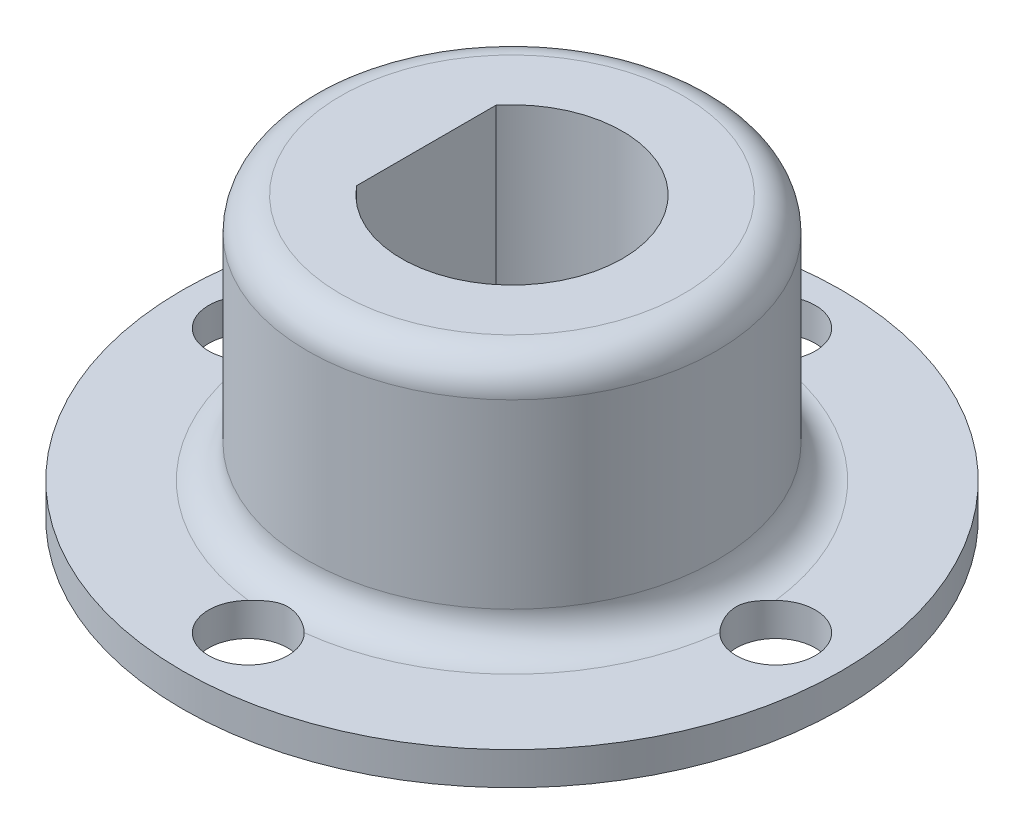
ISO-10303-21;
HEADER;
FILE_DESCRIPTION(('STEP AP214'),'2;1');
FILE_NAME('part.step','',(''),(''),'','','');
FILE_SCHEMA(('AUTOMOTIVE_DESIGN { 1 0 10303 214 1 1 1 1 }'));
ENDSEC;
DATA;
#1=APPLICATION_CONTEXT('core data for automotive mechanical design processes');
#2=APPLICATION_PROTOCOL_DEFINITION('international standard','automotive_design',2000,#1);
#3=PRODUCT_CONTEXT('',#1,'mechanical');
#4=PRODUCT('Part','Part','',(#3));
#5=PRODUCT_RELATED_PRODUCT_CATEGORY('part','',(#4));
#6=PRODUCT_DEFINITION_FORMATION('','',#4);
#7=PRODUCT_DEFINITION_CONTEXT('part definition',#1,'design');
#8=PRODUCT_DEFINITION('design','',#6,#7);
#9=PRODUCT_DEFINITION_SHAPE('','',#8);
#10=(LENGTH_UNIT() NAMED_UNIT(*) SI_UNIT(.MILLI.,.METRE.));
#11=(NAMED_UNIT(*) PLANE_ANGLE_UNIT() SI_UNIT($,.RADIAN.));
#12=(NAMED_UNIT(*) SI_UNIT($,.STERADIAN.) SOLID_ANGLE_UNIT());
#13=UNCERTAINTY_MEASURE_WITH_UNIT(LENGTH_MEASURE(1.E-05),#10,'distance_accuracy_value','');
#14=(GEOMETRIC_REPRESENTATION_CONTEXT(3) GLOBAL_UNCERTAINTY_ASSIGNED_CONTEXT((#13)) GLOBAL_UNIT_ASSIGNED_CONTEXT((#10,
#11,#12)) REPRESENTATION_CONTEXT('',''));
#15=CARTESIAN_POINT('',(0.,0.,0.));
#16=DIRECTION('',(0.,0.,1.));
#17=DIRECTION('',(1.,0.,0.));
#18=AXIS2_PLACEMENT_3D('',#15,#16,#17);
#19=CARTESIAN_POINT('',(-10.,0.,0.));
#20=DIRECTION('',(0.,1.,0.));
#21=DIRECTION('',(0.,0.,1.));
#22=AXIS2_PLACEMENT_3D('',#19,#20,#21);
#23=PLANE('',#22);
#24=CARTESIAN_POINT('',(0.,0.,8.));
#25=DIRECTION('',(0.,-1.,0.));
#26=DIRECTION('',(0.,0.,-1.));
#27=AXIS2_PLACEMENT_3D('',#24,#25,#26);
#28=CIRCLE('',#27,1.19999999999999);
#29=CARTESIAN_POINT('',(0.,0.,6.80000000000001));
#30=VERTEX_POINT('',#29);
#31=EDGE_CURVE('E108',#30,#30,#28,.T.);
#32=ORIENTED_EDGE('',*,*,#31,.F.);
#33=EDGE_LOOP('',(#32));
#34=FACE_BOUND('',#33,.T.);
#35=CARTESIAN_POINT('',(8.,0.,0.));
#36=DIRECTION('',(0.,-1.,0.));
#37=DIRECTION('',(0.,0.,-1.));
#38=AXIS2_PLACEMENT_3D('',#35,#36,#37);
#39=CIRCLE('',#38,1.19999999999999);
#40=CARTESIAN_POINT('',(8.,0.,-1.19999999999999));
#41=VERTEX_POINT('',#40);
#42=EDGE_CURVE('E107',#41,#41,#39,.T.);
#43=ORIENTED_EDGE('',*,*,#42,.F.);
#44=EDGE_LOOP('',(#43));
#45=FACE_BOUND('',#44,.T.);
#46=CARTESIAN_POINT('',(0.,0.,-8.));
#47=DIRECTION('',(0.,-1.,0.));
#48=DIRECTION('',(0.,0.,-1.));
#49=AXIS2_PLACEMENT_3D('',#46,#47,#48);
#50=CIRCLE('',#49,1.19999999999999);
#51=CARTESIAN_POINT('',(0.,0.,-9.19999999999999));
#52=VERTEX_POINT('',#51);
#53=EDGE_CURVE('E263',#52,#52,#50,.T.);
#54=ORIENTED_EDGE('',*,*,#53,.F.);
#55=EDGE_LOOP('',(#54));
#56=FACE_BOUND('',#55,.T.);
#57=CARTESIAN_POINT('',(-8.,0.,0.));
#58=DIRECTION('',(0.,-1.,0.));
#59=DIRECTION('',(0.,0.,-1.));
#60=AXIS2_PLACEMENT_3D('',#57,#58,#59);
#61=CIRCLE('',#60,1.19999999999999);
#62=CARTESIAN_POINT('',(-8.,0.,-1.19999999999999));
#63=VERTEX_POINT('',#62);
#64=EDGE_CURVE('E241',#63,#63,#61,.T.);
#65=ORIENTED_EDGE('',*,*,#64,.F.);
#66=EDGE_LOOP('',(#65));
#67=FACE_BOUND('',#66,.T.);
#68=DIRECTION('',(0.,0.,1.));
#69=VECTOR('',#68,1.);
#70=CARTESIAN_POINT('',(-2.6,0.,0.));
#71=LINE('',#70,#69);
#72=CARTESIAN_POINT('',(-2.6,0.,-2.11246301742776));
#73=VERTEX_POINT('',#72);
#74=CARTESIAN_POINT('',(-2.6,0.,2.11246301742776));
#75=VERTEX_POINT('',#74);
#76=EDGE_CURVE('E229',#73,#75,#71,.T.);
#77=ORIENTED_EDGE('',*,*,#76,.T.);
#78=CARTESIAN_POINT('',(0.,0.,0.));
#79=DIRECTION('',(0.,1.,0.));
#80=DIRECTION('',(0.,0.,1.));
#81=AXIS2_PLACEMENT_3D('',#78,#79,#80);
#82=CIRCLE('',#81,3.35);
#83=EDGE_CURVE('E226',#75,#73,#82,.T.);
#84=ORIENTED_EDGE('',*,*,#83,.T.);
#85=EDGE_LOOP('',(#77,#84));
#86=FACE_BOUND('',#85,.T.);
#87=CARTESIAN_POINT('',(0.,0.,0.));
#88=DIRECTION('',(0.,-1.,0.));
#89=DIRECTION('',(0.,0.,-1.));
#90=AXIS2_PLACEMENT_3D('',#87,#88,#89);
#91=CIRCLE('',#90,10.);
#92=CARTESIAN_POINT('',(0.,0.,-10.));
#93=VERTEX_POINT('',#92);
#94=EDGE_CURVE('E122',#93,#93,#91,.T.);
#95=ORIENTED_EDGE('',*,*,#94,.T.);
#96=EDGE_LOOP('',(#95));
#97=FACE_BOUND('',#96,.T.);
#98=ADVANCED_FACE('F39',(#34,#45,#56,#67,#86,#97),#23,.F.);
#99=CARTESIAN_POINT('',(0.,8.5,0.));
#100=DIRECTION('',(0.,-1.,0.));
#101=DIRECTION('',(0.,0.,-1.));
#102=AXIS2_PLACEMENT_3D('',#99,#100,#101);
#103=PLANE('',#102);
#104=CARTESIAN_POINT('',(0.,8.5,0.));
#105=DIRECTION('',(0.,-1.,0.));
#106=DIRECTION('',(0.,0.,-1.));
#107=AXIS2_PLACEMENT_3D('',#104,#105,#106);
#108=CIRCLE('',#107,5.2);
#109=CARTESIAN_POINT('',(0.,8.5,-5.2));
#110=VERTEX_POINT('',#109);
#111=EDGE_CURVE('E177',#110,#110,#108,.F.);
#112=ORIENTED_EDGE('',*,*,#111,.T.);
#113=EDGE_LOOP('',(#112));
#114=FACE_BOUND('',#113,.T.);
#115=DIRECTION('',(0.,0.,1.));
#116=VECTOR('',#115,1.);
#117=CARTESIAN_POINT('',(-2.6,8.5,-2.11246301742776));
#118=LINE('',#117,#116);
#119=CARTESIAN_POINT('',(-2.6,8.5,-2.11246301742776));
#120=VERTEX_POINT('',#119);
#121=CARTESIAN_POINT('',(-2.6,8.5,2.11246301742776));
#122=VERTEX_POINT('',#121);
#123=EDGE_CURVE('E233',#120,#122,#118,.T.);
#124=ORIENTED_EDGE('',*,*,#123,.F.);
#125=CARTESIAN_POINT('',(0.,8.5,0.));
#126=DIRECTION('',(0.,1.,0.));
#127=DIRECTION('',(0.,0.,1.));
#128=AXIS2_PLACEMENT_3D('',#125,#126,#127);
#129=CIRCLE('',#128,3.35);
#130=EDGE_CURVE('E223',#122,#120,#129,.T.);
#131=ORIENTED_EDGE('',*,*,#130,.F.);
#132=EDGE_LOOP('',(#124,#131));
#133=FACE_BOUND('',#132,.T.);
#134=ADVANCED_FACE('F197',(#114,#133),#103,.F.);
#135=CARTESIAN_POINT('',(0.,0.,0.));
#136=DIRECTION('',(0.,-1.,0.));
#137=DIRECTION('',(0.,0.,-1.));
#138=AXIS2_PLACEMENT_3D('',#135,#136,#137);
#139=CYLINDRICAL_SURFACE('',#138,6.2);
#140=CARTESIAN_POINT('',(0.,2.,0.));
#141=DIRECTION('',(0.,-1.,0.));
#142=DIRECTION('',(0.,0.,-1.));
#143=AXIS2_PLACEMENT_3D('',#140,#141,#142);
#144=CIRCLE('',#143,6.2);
#145=CARTESIAN_POINT('',(0.,2.,-6.2));
#146=VERTEX_POINT('',#145);
#147=EDGE_CURVE('E132',#146,#146,#144,.F.);
#148=ORIENTED_EDGE('',*,*,#147,.T.);
#149=EDGE_LOOP('',(#148));
#150=FACE_BOUND('',#149,.T.);
#151=CARTESIAN_POINT('',(0.,7.5,0.));
#152=DIRECTION('',(0.,-1.,0.));
#153=DIRECTION('',(0.,0.,-1.));
#154=AXIS2_PLACEMENT_3D('',#151,#152,#153);
#155=CIRCLE('',#154,6.2);
#156=CARTESIAN_POINT('',(0.,7.5,-6.2));
#157=VERTEX_POINT('',#156);
#158=EDGE_CURVE('E127',#157,#157,#155,.T.);
#159=ORIENTED_EDGE('',*,*,#158,.T.);
#160=EDGE_LOOP('',(#159));
#161=FACE_BOUND('',#160,.T.);
#162=ADVANCED_FACE('F185',(#150,#161),#139,.T.);
#163=CARTESIAN_POINT('',(-6.2,1.,0.));
#164=DIRECTION('',(0.,-1.,0.));
#165=DIRECTION('',(0.,0.,-1.));
#166=AXIS2_PLACEMENT_3D('',#163,#164,#165);
#167=PLANE('',#166);
#168=CARTESIAN_POINT('',(0.,1.,0.));
#169=DIRECTION('',(0.,-1.,0.));
#170=DIRECTION('',(0.,0.,-1.));
#171=AXIS2_PLACEMENT_3D('',#168,#169,#170);
#172=CIRCLE('',#171,7.2);
#173=CARTESIAN_POINT('',(7.1499999999994,0.999999999999663,0.847053717304916));
#174=VERTEX_POINT('',#173);
#175=CARTESIAN_POINT('',(0.847053717304788,1.,7.15000000000001));
#176=VERTEX_POINT('',#175);
#177=EDGE_CURVE('E105',#174,#176,#172,.T.);
#178=ORIENTED_EDGE('',*,*,#177,.T.);
#179=CARTESIAN_POINT('',(0.,1.,8.));
#180=DIRECTION('',(0.,-1.,0.));
#181=DIRECTION('',(0.,0.,-1.));
#182=AXIS2_PLACEMENT_3D('',#179,#180,#181);
#183=CIRCLE('',#182,1.19999999999999);
#184=CARTESIAN_POINT('',(-0.847053717304991,0.999999999999663,7.14999999999939));
#185=VERTEX_POINT('',#184);
#186=EDGE_CURVE('E59',#176,#185,#183,.T.);
#187=ORIENTED_EDGE('',*,*,#186,.T.);
#188=CARTESIAN_POINT('',(-7.15,1.,0.847053717304863));
#189=VERTEX_POINT('',#188);
#190=EDGE_CURVE('E103',#185,#189,#172,.T.);
#191=ORIENTED_EDGE('',*,*,#190,.T.);
#192=CARTESIAN_POINT('',(-8.,1.,0.));
#193=DIRECTION('',(0.,-1.,0.));
#194=DIRECTION('',(0.,0.,-1.));
#195=AXIS2_PLACEMENT_3D('',#192,#193,#194);
#196=CIRCLE('',#195,1.19999999999999);
#197=CARTESIAN_POINT('',(-7.1499999999994,0.999999999999663,-0.847053717304916));
#198=VERTEX_POINT('',#197);
#199=EDGE_CURVE('E238',#189,#198,#196,.T.);
#200=ORIENTED_EDGE('',*,*,#199,.T.);
#201=CARTESIAN_POINT('',(-0.847053717304838,1.,-7.15));
#202=VERTEX_POINT('',#201);
#203=EDGE_CURVE('E117',#198,#202,#172,.T.);
#204=ORIENTED_EDGE('',*,*,#203,.T.);
#205=CARTESIAN_POINT('',(0.,1.,-8.));
#206=DIRECTION('',(0.,-1.,0.));
#207=DIRECTION('',(0.,0.,-1.));
#208=AXIS2_PLACEMENT_3D('',#205,#206,#207);
#209=CIRCLE('',#208,1.19999999999999);
#210=CARTESIAN_POINT('',(0.847053717304941,0.999999999999663,-7.14999999999939));
#211=VERTEX_POINT('',#210);
#212=EDGE_CURVE('E135',#202,#211,#209,.T.);
#213=ORIENTED_EDGE('',*,*,#212,.T.);
#214=CARTESIAN_POINT('',(7.15,1.,-0.847053717304862));
#215=VERTEX_POINT('',#214);
#216=EDGE_CURVE('E120',#211,#215,#172,.T.);
#217=ORIENTED_EDGE('',*,*,#216,.T.);
#218=CARTESIAN_POINT('',(8.,1.,0.));
#219=DIRECTION('',(0.,-1.,0.));
#220=DIRECTION('',(0.,0.,-1.));
#221=AXIS2_PLACEMENT_3D('',#218,#219,#220);
#222=CIRCLE('',#221,1.19999999999999);
#223=EDGE_CURVE('E65',#215,#174,#222,.T.);
#224=ORIENTED_EDGE('',*,*,#223,.T.);
#225=EDGE_LOOP('',(#178,#187,#191,#200,#204,#213,#217,#224));
#226=FACE_BOUND('',#225,.T.);
#227=CARTESIAN_POINT('',(0.,1.,0.));
#228=DIRECTION('',(0.,-1.,0.));
#229=DIRECTION('',(0.,0.,-1.));
#230=AXIS2_PLACEMENT_3D('',#227,#228,#229);
#231=CIRCLE('',#230,10.);
#232=CARTESIAN_POINT('',(0.,1.,-10.));
#233=VERTEX_POINT('',#232);
#234=EDGE_CURVE('E115',#233,#233,#231,.T.);
#235=ORIENTED_EDGE('',*,*,#234,.F.);
#236=EDGE_LOOP('',(#235));
#237=FACE_BOUND('',#236,.T.);
#238=ADVANCED_FACE('F100',(#226,#237),#167,.F.);
#239=CARTESIAN_POINT('',(0.,0.,0.));
#240=DIRECTION('',(0.,-1.,0.));
#241=DIRECTION('',(0.,0.,-1.));
#242=AXIS2_PLACEMENT_3D('',#239,#240,#241);
#243=CYLINDRICAL_SURFACE('',#242,10.);
#244=ORIENTED_EDGE('',*,*,#94,.F.);
#245=EDGE_LOOP('',(#244));
#246=FACE_BOUND('',#245,.T.);
#247=ORIENTED_EDGE('',*,*,#234,.T.);
#248=EDGE_LOOP('',(#247));
#249=FACE_BOUND('',#248,.T.);
#250=ADVANCED_FACE('F211',(#246,#249),#243,.T.);
#251=CARTESIAN_POINT('',(0.,-1.5,0.));
#252=DIRECTION('',(0.,1.,0.));
#253=DIRECTION('',(0.,0.,1.));
#254=AXIS2_PLACEMENT_3D('',#251,#252,#253);
#255=CYLINDRICAL_SURFACE('',#254,3.35);
#256=DIRECTION('',(0.,1.,0.));
#257=VECTOR('',#256,1.);
#258=CARTESIAN_POINT('',(-2.6,-1.5,2.11246301742776));
#259=LINE('',#258,#257);
#260=EDGE_CURVE('E219',#75,#122,#259,.T.);
#261=ORIENTED_EDGE('',*,*,#260,.T.);
#262=ORIENTED_EDGE('',*,*,#130,.T.);
#263=DIRECTION('',(0.,1.,0.));
#264=VECTOR('',#263,1.);
#265=CARTESIAN_POINT('',(-2.6,-1.5,-2.11246301742776));
#266=LINE('',#265,#264);
#267=EDGE_CURVE('E230',#73,#120,#266,.T.);
#268=ORIENTED_EDGE('',*,*,#267,.F.);
#269=ORIENTED_EDGE('',*,*,#83,.F.);
#270=EDGE_LOOP('',(#261,#262,#268,#269));
#271=FACE_BOUND('',#270,.T.);
#272=ADVANCED_FACE('F194',(#271),#255,.F.);
#273=CARTESIAN_POINT('',(-2.6,-1.5,-2.11246301742776));
#274=DIRECTION('',(-1.,0.,0.));
#275=DIRECTION('',(0.,0.,1.));
#276=AXIS2_PLACEMENT_3D('',#273,#274,#275);
#277=PLANE('',#276);
#278=ORIENTED_EDGE('',*,*,#267,.T.);
#279=ORIENTED_EDGE('',*,*,#123,.T.);
#280=ORIENTED_EDGE('',*,*,#260,.F.);
#281=ORIENTED_EDGE('',*,*,#76,.F.);
#282=EDGE_LOOP('',(#278,#279,#280,#281));
#283=FACE_BOUND('',#282,.T.);
#284=ADVANCED_FACE('F169',(#283),#277,.F.);
#285=CARTESIAN_POINT('',(0.,2.,0.));
#286=DIRECTION('',(0.,-1.,0.));
#287=DIRECTION('',(0.,0.,-1.));
#288=AXIS2_PLACEMENT_3D('',#285,#286,#287);
#289=TOROIDAL_SURFACE('',#288,7.2,1.);
#290=ORIENTED_EDGE('',*,*,#147,.F.);
#291=EDGE_LOOP('',(#290));
#292=FACE_BOUND('',#291,.T.);
#293=ORIENTED_EDGE('',*,*,#190,.F.);
#294=CARTESIAN_POINT('',(-0.894606036197013,1.00154483800933,7.2002));
#295=CARTESIAN_POINT('',(-0.873828301543019,1.00011617939023,7.17695327964323));
#296=CARTESIAN_POINT('',(-0.852130762550501,0.999723743466747,7.15451356580517));
#297=CARTESIAN_POINT('',(-0.807107588007335,1.00063506281877,7.11143680846484));
#298=CARTESIAN_POINT('',(-0.783784537403636,1.00193618067456,7.09079701526097));
#299=CARTESIAN_POINT('',(-0.711825731325502,1.00779723447702,7.03194594591043));
#300=CARTESIAN_POINT('',(-0.660995228230699,1.01430836783185,6.99657455841611));
#301=CARTESIAN_POINT('',(-0.555092385153587,1.0294576816575,6.93433605775005));
#302=CARTESIAN_POINT('',(-0.500041507872087,1.03808553434743,6.90742905858751));
#303=CARTESIAN_POINT('',(-0.386284694627412,1.05461758979803,6.86222884993569));
#304=CARTESIAN_POINT('',(-0.327575108883729,1.06252104987433,6.84394440287178));
#305=CARTESIAN_POINT('',(-0.234516913569418,1.07228382799207,6.82264611256277));
#306=CARTESIAN_POINT('',(-0.200985953669649,1.07526655168514,6.81645881157566));
#307=CARTESIAN_POINT('',(-0.133435576109057,1.07993775283482,6.8069549304148));
#308=CARTESIAN_POINT('',(-0.0994163810203757,1.08162680207236,6.80363708191063));
#309=CARTESIAN_POINT('',(-0.0312102938765849,1.08352227167521,6.79992041441983));
#310=CARTESIAN_POINT('',(0.0029763962229315,1.08373017448256,6.79951867676391));
#311=CARTESIAN_POINT('',(0.0712260934963633,1.08265105152339,6.80162868283927));
#312=CARTESIAN_POINT('',(0.105289108590275,1.08136412324035,6.804140236584));
#313=CARTESIAN_POINT('',(0.199701455483022,1.07585941454391,6.81516736595893));
#314=CARTESIAN_POINT('',(0.259619676029283,1.0701314472088,6.82685409124474));
#315=CARTESIAN_POINT('',(0.37679207953388,1.05610554727345,6.85906290688051));
#316=CARTESIAN_POINT('',(0.434039984232188,1.0478018778684,6.87960476026715));
#317=CARTESIAN_POINT('',(0.549106875573933,1.03058501006995,6.93100150806331));
#318=CARTESIAN_POINT('',(0.6066242872361,1.02167460958853,6.96253398723387));
#319=CARTESIAN_POINT('',(0.715932842106704,1.00750036014036,7.0347571290096));
#320=CARTESIAN_POINT('',(0.767746139146181,1.00222195274148,7.07541035216005));
#321=CARTESIAN_POINT('',(0.829627147079521,1.00008151586477,7.13277886841924));
#322=CARTESIAN_POINT('',(0.843064408040164,0.999900491195247,7.14583710241135));
#323=CARTESIAN_POINT('',(0.869313669498975,1.00020391519943,7.17256802399563));
#324=CARTESIAN_POINT('',(0.882125463236981,1.00068858240835,7.18624091194262));
#325=CARTESIAN_POINT('',(0.894606036196845,1.00154483800933,7.2002));
#326=B_SPLINE_CURVE_WITH_KNOTS('',3,(#294,#295,#296,#297,#298,#299,#300,#301,#302,#303,#304,
#305,#306,#307,#308,#309,#310,#311,#312,#313,#314,#315,#316,#317,#318,#319,#320,#321,#322,#323,
#324,#325),.UNSPECIFIED.,.F.,.F.,(4,2,2,2,2,2,2,2,2,2,2,2,2,2,2,4),(0.,0.0935353562887206,
0.186925221430045,0.372797487287825,0.557780288128273,0.742950669573354,0.845506184796447,
0.948016346121064,1.05042389318204,1.15282476224185,1.33589322896198,1.51937240390641,
1.71711509009601,1.91406045603419,1.97024902492031,2.02645604395826),.UNSPECIFIED.);
#327=EDGE_CURVE('E11',#185,#176,#326,.T.);
#328=ORIENTED_EDGE('',*,*,#327,.T.);
#329=ORIENTED_EDGE('',*,*,#177,.F.);
#330=CARTESIAN_POINT('',(7.2002,1.00154483800933,0.894606036196928));
#331=CARTESIAN_POINT('',(7.17695327964323,1.00011617939023,0.873828301542934));
#332=CARTESIAN_POINT('',(7.15451356580517,0.999723743466747,0.852130762550416));
#333=CARTESIAN_POINT('',(7.11143680846484,1.00063506281877,0.80710758800725));
#334=CARTESIAN_POINT('',(7.09079701526097,1.00193618067456,0.783784537403552));
#335=CARTESIAN_POINT('',(7.03194594591043,1.00779723447702,0.711825731325417));
#336=CARTESIAN_POINT('',(6.99657455841611,1.01430836783185,0.660995228230613));
#337=CARTESIAN_POINT('',(6.93433605775005,1.0294576816575,0.5550923851535));
#338=CARTESIAN_POINT('',(6.90742905858751,1.03808553434743,0.500041507871999));
#339=CARTESIAN_POINT('',(6.86222884993569,1.05461758979804,0.386284694627323));
#340=CARTESIAN_POINT('',(6.84394440287178,1.06252104987433,0.32757510888364));
#341=CARTESIAN_POINT('',(6.82264611256277,1.07228382799207,0.234516913569327));
#342=CARTESIAN_POINT('',(6.81645881157566,1.07526655168514,0.200985953669559));
#343=CARTESIAN_POINT('',(6.8069549304148,1.07993775283482,0.133435576108967));
#344=CARTESIAN_POINT('',(6.80363708191063,1.08162680207236,0.0994163810202857));
#345=CARTESIAN_POINT('',(6.79992041441983,1.08352227167521,0.0312102938764951));
#346=CARTESIAN_POINT('',(6.79951867676391,1.08373017448256,-0.00297639622302117));
#347=CARTESIAN_POINT('',(6.80162868283927,1.08265105152339,-0.0712260934964527));
#348=CARTESIAN_POINT('',(6.804140236584,1.08136412324035,-0.105289108590364));
#349=CARTESIAN_POINT('',(6.81516736595893,1.07585941454391,-0.199701455483111));
#350=CARTESIAN_POINT('',(6.82685409124474,1.0701314472088,-0.259619676029372));
#351=CARTESIAN_POINT('',(6.85906290688051,1.05610554727344,-0.376792079533969));
#352=CARTESIAN_POINT('',(6.87960476026715,1.04780187786839,-0.434039984232276));
#353=CARTESIAN_POINT('',(6.93100150806331,1.03058501006995,-0.549106875574021));
#354=CARTESIAN_POINT('',(6.96253398723387,1.02167460958853,-0.606624287236188));
#355=CARTESIAN_POINT('',(7.03475712900961,1.00750036014036,-0.715932842106792));
#356=CARTESIAN_POINT('',(7.07541035216006,1.00222195274148,-0.76774613914627));
#357=CARTESIAN_POINT('',(7.13277886841924,1.00008151586477,-0.829627147079609));
#358=CARTESIAN_POINT('',(7.14583710241136,0.999900491195247,-0.843064408040251));
#359=CARTESIAN_POINT('',(7.17256802399563,1.00020391519943,-0.86931366949906));
#360=CARTESIAN_POINT('',(7.18624091194262,1.00068858240835,-0.882125463237065));
#361=CARTESIAN_POINT('',(7.2002,1.00154483800933,-0.894606036196929));
#362=B_SPLINE_CURVE_WITH_KNOTS('',3,(#330,#331,#332,#333,#334,#335,#336,#337,#338,#339,#340,
#341,#342,#343,#344,#345,#346,#347,#348,#349,#350,#351,#352,#353,#354,#355,#356,#357,#358,#359,
#360,#361),.UNSPECIFIED.,.F.,.F.,(4,2,2,2,2,2,2,2,2,2,2,2,2,2,2,4),(0.,0.0935353562887209,
0.186925221430046,0.372797487287827,0.557780288128277,0.74295066957336,0.845506184796453,
0.948016346121069,1.05042389318204,1.15282476224186,1.33589322896199,1.51937240390642,
1.71711509009601,1.91406045603419,1.97024902492031,2.02645604395825),.UNSPECIFIED.);
#363=EDGE_CURVE('E53',#174,#215,#362,.T.);
#364=ORIENTED_EDGE('',*,*,#363,.T.);
#365=ORIENTED_EDGE('',*,*,#216,.F.);
#366=CARTESIAN_POINT('',(0.894606036196957,1.00154483800933,-7.2002));
#367=CARTESIAN_POINT('',(0.873828301542963,1.00011617939023,-7.17695327964323));
#368=CARTESIAN_POINT('',(0.852130762550445,0.999723743466747,-7.15451356580517));
#369=CARTESIAN_POINT('',(0.807107588007279,1.00063506281877,-7.11143680846484));
#370=CARTESIAN_POINT('',(0.78378453740358,1.00193618067456,-7.09079701526097));
#371=CARTESIAN_POINT('',(0.711825731325445,1.00779723447702,-7.03194594591043));
#372=CARTESIAN_POINT('',(0.660995228230642,1.01430836783185,-6.99657455841611));
#373=CARTESIAN_POINT('',(0.555092385153529,1.0294576816575,-6.93433605775005));
#374=CARTESIAN_POINT('',(0.500041507872028,1.03808553434743,-6.90742905858751));
#375=CARTESIAN_POINT('',(0.386284694627353,1.05461758979804,-6.86222884993569));
#376=CARTESIAN_POINT('',(0.32757510888367,1.06252104987433,-6.84394440287178));
#377=CARTESIAN_POINT('',(0.234516913569357,1.07228382799207,-6.82264611256277));
#378=CARTESIAN_POINT('',(0.200985953669588,1.07526655168514,-6.81645881157565));
#379=CARTESIAN_POINT('',(0.133435576108996,1.07993775283482,-6.8069549304148));
#380=CARTESIAN_POINT('',(0.099416381020315,1.08162680207236,-6.80363708191063));
#381=CARTESIAN_POINT('',(0.0312102938765242,1.08352227167521,-6.79992041441983));
#382=CARTESIAN_POINT('',(-0.00297639622299209,1.08373017448256,-6.79951867676391));
#383=CARTESIAN_POINT('',(-0.0712260934964239,1.08265105152339,-6.80162868283927));
#384=CARTESIAN_POINT('',(-0.105289108590335,1.08136412324035,-6.804140236584));
#385=CARTESIAN_POINT('',(-0.199701455483083,1.07585941454391,-6.81516736595893));
#386=CARTESIAN_POINT('',(-0.259619676029343,1.0701314472088,-6.82685409124474));
#387=CARTESIAN_POINT('',(-0.37679207953394,1.05610554727344,-6.85906290688051));
#388=CARTESIAN_POINT('',(-0.434039984232247,1.04780187786839,-6.87960476026715));
#389=CARTESIAN_POINT('',(-0.549106875573992,1.03058501006995,-6.93100150806331));
#390=CARTESIAN_POINT('',(-0.606624287236159,1.02167460958853,-6.96253398723387));
#391=CARTESIAN_POINT('',(-0.715932842106763,1.00750036014036,-7.0347571290096));
#392=CARTESIAN_POINT('',(-0.76774613914624,1.00222195274148,-7.07541035216006));
#393=CARTESIAN_POINT('',(-0.82962714707958,1.00008151586477,-7.13277886841924));
#394=CARTESIAN_POINT('',(-0.843064408040222,0.999900491195247,-7.14583710241136));
#395=CARTESIAN_POINT('',(-0.869313669499032,1.00020391519943,-7.17256802399563));
#396=CARTESIAN_POINT('',(-0.882125463237038,1.00068858240835,-7.18624091194262));
#397=CARTESIAN_POINT('',(-0.894606036196901,1.00154483800933,-7.2002));
#398=B_SPLINE_CURVE_WITH_KNOTS('',3,(#366,#367,#368,#369,#370,#371,#372,#373,#374,#375,#376,
#377,#378,#379,#380,#381,#382,#383,#384,#385,#386,#387,#388,#389,#390,#391,#392,#393,#394,#395,
#396,#397),.UNSPECIFIED.,.F.,.F.,(4,2,2,2,2,2,2,2,2,2,2,2,2,2,2,4),(0.,0.0935353562887209,
0.186925221430046,0.372797487287827,0.557780288128276,0.742950669573359,0.845506184796452,
0.948016346121069,1.05042389318204,1.15282476224186,1.33589322896199,1.51937240390642,
1.71711509009601,1.91406045603419,1.97024902492031,2.02645604395826),.UNSPECIFIED.);
#399=EDGE_CURVE('E137',#211,#202,#398,.T.);
#400=ORIENTED_EDGE('',*,*,#399,.T.);
#401=ORIENTED_EDGE('',*,*,#203,.F.);
#402=CARTESIAN_POINT('',(-7.2002,1.00154483800933,-0.894606036196929));
#403=CARTESIAN_POINT('',(-7.17695327964323,1.00011617939023,-0.873828301542935));
#404=CARTESIAN_POINT('',(-7.15451356580517,0.999723743466747,-0.852130762550417));
#405=CARTESIAN_POINT('',(-7.11143680846483,1.00063506281877,-0.807107588007251));
#406=CARTESIAN_POINT('',(-7.09079701526097,1.00193618067456,-0.783784537403552));
#407=CARTESIAN_POINT('',(-7.03194594591043,1.00779723447702,-0.711825731325417));
#408=CARTESIAN_POINT('',(-6.99657455841611,1.01430836783185,-0.660995228230614));
#409=CARTESIAN_POINT('',(-6.93433605775005,1.0294576816575,-0.555092385153501));
#410=CARTESIAN_POINT('',(-6.90742905858751,1.03808553434743,-0.500041507872));
#411=CARTESIAN_POINT('',(-6.86222884993569,1.05461758979804,-0.386284694627324));
#412=CARTESIAN_POINT('',(-6.84394440287178,1.06252104987433,-0.327575108883641));
#413=CARTESIAN_POINT('',(-6.82264611256277,1.07228382799207,-0.234516913569329));
#414=CARTESIAN_POINT('',(-6.81645881157565,1.07526655168514,-0.20098595366956));
#415=CARTESIAN_POINT('',(-6.8069549304148,1.07993775283482,-0.133435576108968));
#416=CARTESIAN_POINT('',(-6.80363708191063,1.08162680207236,-0.0994163810202867));
#417=CARTESIAN_POINT('',(-6.79992041441983,1.08352227167521,-0.031210293876496));
#418=CARTESIAN_POINT('',(-6.79951867676391,1.08373017448256,0.00297639622302028));
#419=CARTESIAN_POINT('',(-6.80162868283927,1.08265105152339,0.071226093496452));
#420=CARTESIAN_POINT('',(-6.804140236584,1.08136412324035,0.105289108590363));
#421=CARTESIAN_POINT('',(-6.81516736595893,1.07585941454391,0.199701455483111));
#422=CARTESIAN_POINT('',(-6.82685409124474,1.0701314472088,0.259619676029371));
#423=CARTESIAN_POINT('',(-6.85906290688051,1.05610554727344,0.376792079533968));
#424=CARTESIAN_POINT('',(-6.87960476026715,1.04780187786839,0.434039984232275));
#425=CARTESIAN_POINT('',(-6.93100150806331,1.03058501006995,0.54910687557402));
#426=CARTESIAN_POINT('',(-6.96253398723387,1.02167460958853,0.606624287236187));
#427=CARTESIAN_POINT('',(-7.03475712900961,1.00750036014036,0.715932842106792));
#428=CARTESIAN_POINT('',(-7.07541035216006,1.00222195274148,0.767746139146269));
#429=CARTESIAN_POINT('',(-7.13277886841924,1.00008151586477,0.829627147079608));
#430=CARTESIAN_POINT('',(-7.14583710241136,0.999900491195247,0.84306440804025));
#431=CARTESIAN_POINT('',(-7.17256802399563,1.00020391519943,0.86931366949906));
#432=CARTESIAN_POINT('',(-7.18624091194262,1.00068858240835,0.882125463237065));
#433=CARTESIAN_POINT('',(-7.2002,1.00154483800933,0.894606036196929));
#434=B_SPLINE_CURVE_WITH_KNOTS('',3,(#402,#403,#404,#405,#406,#407,#408,#409,#410,#411,#412,
#413,#414,#415,#416,#417,#418,#419,#420,#421,#422,#423,#424,#425,#426,#427,#428,#429,#430,#431,
#432,#433),.UNSPECIFIED.,.F.,.F.,(4,2,2,2,2,2,2,2,2,2,2,2,2,2,2,4),(0.,0.0935353562887216,
0.186925221430046,0.372797487287827,0.557780288128277,0.742950669573359,0.845506184796453,
0.948016346121069,1.05042389318204,1.15282476224186,1.33589322896199,1.51937240390642,
1.71711509009601,1.91406045603419,1.97024902492031,2.02645604395826),.UNSPECIFIED.);
#435=EDGE_CURVE('E113',#198,#189,#434,.T.);
#436=ORIENTED_EDGE('',*,*,#435,.T.);
#437=EDGE_LOOP('',(#293,#328,#329,#364,#365,#400,#401,#436));
#438=FACE_BOUND('',#437,.T.);
#439=ADVANCED_FACE('F111',(#292,#438),#289,.F.);
#440=CARTESIAN_POINT('',(0.,7.5,0.));
#441=DIRECTION('',(0.,-1.,0.));
#442=DIRECTION('',(0.,0.,-1.));
#443=AXIS2_PLACEMENT_3D('',#440,#441,#442);
#444=TOROIDAL_SURFACE('',#443,5.2,1.);
#445=ORIENTED_EDGE('',*,*,#111,.F.);
#446=EDGE_LOOP('',(#445));
#447=FACE_BOUND('',#446,.T.);
#448=ORIENTED_EDGE('',*,*,#158,.F.);
#449=EDGE_LOOP('',(#448));
#450=FACE_BOUND('',#449,.T.);
#451=ADVANCED_FACE('F41',(#447,#450),#444,.T.);
#452=CARTESIAN_POINT('',(-8.,0.,0.));
#453=DIRECTION('',(0.,-1.,0.));
#454=DIRECTION('',(0.,0.,-1.));
#455=AXIS2_PLACEMENT_3D('',#452,#453,#454);
#456=CYLINDRICAL_SURFACE('',#455,1.19999999999999);
#457=ORIENTED_EDGE('',*,*,#64,.T.);
#458=EDGE_LOOP('',(#457));
#459=FACE_BOUND('',#458,.T.);
#460=ORIENTED_EDGE('',*,*,#435,.F.);
#461=ORIENTED_EDGE('',*,*,#199,.F.);
#462=EDGE_LOOP('',(#460,#461));
#463=FACE_BOUND('',#462,.T.);
#464=ADVANCED_FACE('F163',(#459,#463),#456,.F.);
#465=CARTESIAN_POINT('',(0.,0.,-8.));
#466=DIRECTION('',(0.,-1.,0.));
#467=DIRECTION('',(0.,0.,-1.));
#468=AXIS2_PLACEMENT_3D('',#465,#466,#467);
#469=CYLINDRICAL_SURFACE('',#468,1.19999999999999);
#470=ORIENTED_EDGE('',*,*,#53,.T.);
#471=EDGE_LOOP('',(#470));
#472=FACE_BOUND('',#471,.T.);
#473=ORIENTED_EDGE('',*,*,#399,.F.);
#474=ORIENTED_EDGE('',*,*,#212,.F.);
#475=EDGE_LOOP('',(#473,#474));
#476=FACE_BOUND('',#475,.T.);
#477=ADVANCED_FACE('F157',(#472,#476),#469,.F.);
#478=CARTESIAN_POINT('',(8.,0.,0.));
#479=DIRECTION('',(0.,-1.,0.));
#480=DIRECTION('',(0.,0.,-1.));
#481=AXIS2_PLACEMENT_3D('',#478,#479,#480);
#482=CYLINDRICAL_SURFACE('',#481,1.19999999999999);
#483=ORIENTED_EDGE('',*,*,#42,.T.);
#484=EDGE_LOOP('',(#483));
#485=FACE_BOUND('',#484,.T.);
#486=ORIENTED_EDGE('',*,*,#363,.F.);
#487=ORIENTED_EDGE('',*,*,#223,.F.);
#488=EDGE_LOOP('',(#486,#487));
#489=FACE_BOUND('',#488,.T.);
#490=ADVANCED_FACE('F154',(#485,#489),#482,.F.);
#491=CARTESIAN_POINT('',(0.,0.,8.));
#492=DIRECTION('',(0.,-1.,0.));
#493=DIRECTION('',(0.,0.,-1.));
#494=AXIS2_PLACEMENT_3D('',#491,#492,#493);
#495=CYLINDRICAL_SURFACE('',#494,1.19999999999999);
#496=ORIENTED_EDGE('',*,*,#31,.T.);
#497=EDGE_LOOP('',(#496));
#498=FACE_BOUND('',#497,.T.);
#499=ORIENTED_EDGE('',*,*,#327,.F.);
#500=ORIENTED_EDGE('',*,*,#186,.F.);
#501=EDGE_LOOP('',(#499,#500));
#502=FACE_BOUND('',#501,.T.);
#503=ADVANCED_FACE('F94',(#498,#502),#495,.F.);
#504=CLOSED_SHELL('',(#98,#134,#162,#238,#250,#272,#284,#439,#451,#464,#477,#490,#503));
#505=MANIFOLD_SOLID_BREP('B2',#504);
#506=ADVANCED_BREP_SHAPE_REPRESENTATION('',(#18,#505),#14);
#507=SHAPE_DEFINITION_REPRESENTATION(#9,#506);
ENDSEC;
END-ISO-10303-21;
